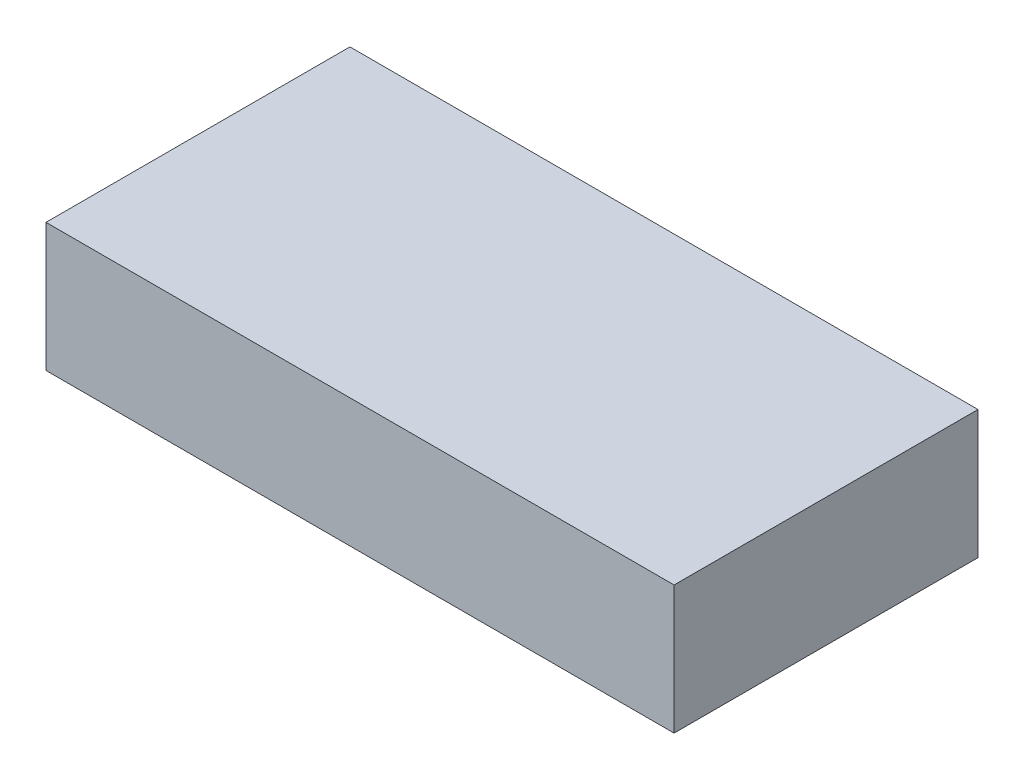
ISO-10303-21;
HEADER;
FILE_DESCRIPTION(('STEP AP214'),'2;1');
FILE_NAME('part.step','',(''),(''),'','','');
FILE_SCHEMA(('AUTOMOTIVE_DESIGN { 1 0 10303 214 1 1 1 1 }'));
ENDSEC;
DATA;
#1=APPLICATION_CONTEXT('core data for automotive mechanical design processes');
#2=APPLICATION_PROTOCOL_DEFINITION('international standard','automotive_design',2000,#1);
#3=PRODUCT_CONTEXT('',#1,'mechanical');
#4=PRODUCT('Part','Part','',(#3));
#5=PRODUCT_RELATED_PRODUCT_CATEGORY('part','',(#4));
#6=PRODUCT_DEFINITION_FORMATION('','',#4);
#7=PRODUCT_DEFINITION_CONTEXT('part definition',#1,'design');
#8=PRODUCT_DEFINITION('design','',#6,#7);
#9=PRODUCT_DEFINITION_SHAPE('','',#8);
#10=(LENGTH_UNIT() NAMED_UNIT(*) SI_UNIT(.MILLI.,.METRE.));
#11=(NAMED_UNIT(*) PLANE_ANGLE_UNIT() SI_UNIT($,.RADIAN.));
#12=(NAMED_UNIT(*) SI_UNIT($,.STERADIAN.) SOLID_ANGLE_UNIT());
#13=UNCERTAINTY_MEASURE_WITH_UNIT(LENGTH_MEASURE(1.E-05),#10,'distance_accuracy_value','');
#14=(GEOMETRIC_REPRESENTATION_CONTEXT(3) GLOBAL_UNCERTAINTY_ASSIGNED_CONTEXT((#13)) GLOBAL_UNIT_ASSIGNED_CONTEXT((#10,
#11,#12)) REPRESENTATION_CONTEXT('',''));
#15=CARTESIAN_POINT('',(0.,0.,0.));
#16=DIRECTION('',(0.,0.,1.));
#17=DIRECTION('',(1.,0.,0.));
#18=AXIS2_PLACEMENT_3D('',#15,#16,#17);
#19=CARTESIAN_POINT('',(-23.1049285714286,14.478,-12.7056696428571));
#20=DIRECTION('',(1.,0.,0.));
#21=DIRECTION('',(0.,0.,-1.));
#22=AXIS2_PLACEMENT_3D('',#19,#20,#21);
#23=PLANE('',#22);
#24=DIRECTION('',(0.,0.,1.));
#25=VECTOR('',#24,1.);
#26=CARTESIAN_POINT('',(-23.1049285714286,0.,-12.7056696428571));
#27=LINE('',#26,#25);
#28=CARTESIAN_POINT('',(-23.1049285714286,0.,-12.7056696428571));
#29=VERTEX_POINT('',#28);
#30=CARTESIAN_POINT('',(-23.1049285714286,0.,21.5843303571429));
#31=VERTEX_POINT('',#30);
#32=EDGE_CURVE('E100',#29,#31,#27,.T.);
#33=ORIENTED_EDGE('',*,*,#32,.T.);
#34=DIRECTION('',(0.,-1.,0.));
#35=VECTOR('',#34,1.);
#36=CARTESIAN_POINT('',(-23.1049285714286,14.478,21.5843303571429));
#37=LINE('',#36,#35);
#38=CARTESIAN_POINT('',(-23.1049285714286,14.478,21.5843303571429));
#39=VERTEX_POINT('',#38);
#40=EDGE_CURVE('E11',#39,#31,#37,.T.);
#41=ORIENTED_EDGE('',*,*,#40,.F.);
#42=DIRECTION('',(0.,0.,1.));
#43=VECTOR('',#42,1.);
#44=CARTESIAN_POINT('',(-23.1049285714286,14.478,-12.7056696428571));
#45=LINE('',#44,#43);
#46=CARTESIAN_POINT('',(-23.1049285714286,14.478,-12.7056696428571));
#47=VERTEX_POINT('',#46);
#48=EDGE_CURVE('E88',#47,#39,#45,.T.);
#49=ORIENTED_EDGE('',*,*,#48,.F.);
#50=DIRECTION('',(0.,-1.,0.));
#51=VECTOR('',#50,1.);
#52=CARTESIAN_POINT('',(-23.1049285714286,14.478,-12.7056696428571));
#53=LINE('',#52,#51);
#54=EDGE_CURVE('E96',#47,#29,#53,.T.);
#55=ORIENTED_EDGE('',*,*,#54,.T.);
#56=EDGE_LOOP('',(#33,#41,#49,#55));
#57=FACE_BOUND('',#56,.T.);
#58=ADVANCED_FACE('F37',(#57),#23,.F.);
#59=CARTESIAN_POINT('',(-23.1049285714286,14.478,21.5843303571429));
#60=DIRECTION('',(0.,0.,-1.));
#61=DIRECTION('',(-1.,0.,0.));
#62=AXIS2_PLACEMENT_3D('',#59,#60,#61);
#63=PLANE('',#62);
#64=DIRECTION('',(1.,0.,0.));
#65=VECTOR('',#64,1.);
#66=CARTESIAN_POINT('',(-23.1049285714286,0.,21.5843303571429));
#67=LINE('',#66,#65);
#68=CARTESIAN_POINT('',(47.7610714285714,0.,21.5843303571429));
#69=VERTEX_POINT('',#68);
#70=EDGE_CURVE('E92',#31,#69,#67,.T.);
#71=ORIENTED_EDGE('',*,*,#70,.T.);
#72=DIRECTION('',(0.,-1.,0.));
#73=VECTOR('',#72,1.);
#74=CARTESIAN_POINT('',(47.7610714285714,14.478,21.5843303571429));
#75=LINE('',#74,#73);
#76=CARTESIAN_POINT('',(47.7610714285714,14.478,21.5843303571429));
#77=VERTEX_POINT('',#76);
#78=EDGE_CURVE('E45',#77,#69,#75,.T.);
#79=ORIENTED_EDGE('',*,*,#78,.F.);
#80=DIRECTION('',(1.,0.,0.));
#81=VECTOR('',#80,1.);
#82=CARTESIAN_POINT('',(-23.1049285714286,14.478,21.5843303571429));
#83=LINE('',#82,#81);
#84=EDGE_CURVE('E83',#39,#77,#83,.T.);
#85=ORIENTED_EDGE('',*,*,#84,.F.);
#86=ORIENTED_EDGE('',*,*,#40,.T.);
#87=EDGE_LOOP('',(#71,#79,#85,#86));
#88=FACE_BOUND('',#87,.T.);
#89=ADVANCED_FACE('F91',(#88),#63,.F.);
#90=CARTESIAN_POINT('',(47.7610714285714,14.478,-12.7056696428571));
#91=DIRECTION('',(-1.,0.,0.));
#92=DIRECTION('',(0.,0.,1.));
#93=AXIS2_PLACEMENT_3D('',#90,#91,#92);
#94=PLANE('',#93);
#95=DIRECTION('',(0.,0.,-1.));
#96=VECTOR('',#95,1.);
#97=CARTESIAN_POINT('',(47.7610714285714,0.,-12.7056696428571));
#98=LINE('',#97,#96);
#99=CARTESIAN_POINT('',(47.7610714285714,0.,-12.7056696428571));
#100=VERTEX_POINT('',#99);
#101=EDGE_CURVE('E70',#69,#100,#98,.T.);
#102=ORIENTED_EDGE('',*,*,#101,.T.);
#103=DIRECTION('',(0.,-1.,0.));
#104=VECTOR('',#103,1.);
#105=CARTESIAN_POINT('',(47.7610714285714,14.478,-12.7056696428571));
#106=LINE('',#105,#104);
#107=CARTESIAN_POINT('',(47.7610714285714,14.478,-12.7056696428571));
#108=VERTEX_POINT('',#107);
#109=EDGE_CURVE('E93',#108,#100,#106,.T.);
#110=ORIENTED_EDGE('',*,*,#109,.F.);
#111=DIRECTION('',(0.,0.,-1.));
#112=VECTOR('',#111,1.);
#113=CARTESIAN_POINT('',(47.7610714285714,14.478,-12.7056696428571));
#114=LINE('',#113,#112);
#115=EDGE_CURVE('E86',#77,#108,#114,.T.);
#116=ORIENTED_EDGE('',*,*,#115,.F.);
#117=ORIENTED_EDGE('',*,*,#78,.T.);
#118=EDGE_LOOP('',(#102,#110,#116,#117));
#119=FACE_BOUND('',#118,.T.);
#120=ADVANCED_FACE('F94',(#119),#94,.F.);
#121=CARTESIAN_POINT('',(-23.1049285714286,14.478,-12.7056696428571));
#122=DIRECTION('',(0.,0.,1.));
#123=DIRECTION('',(1.,0.,0.));
#124=AXIS2_PLACEMENT_3D('',#121,#122,#123);
#125=PLANE('',#124);
#126=DIRECTION('',(-1.,0.,0.));
#127=VECTOR('',#126,1.);
#128=CARTESIAN_POINT('',(-23.1049285714286,0.,-12.7056696428571));
#129=LINE('',#128,#127);
#130=EDGE_CURVE('E76',#100,#29,#129,.T.);
#131=ORIENTED_EDGE('',*,*,#130,.T.);
#132=ORIENTED_EDGE('',*,*,#54,.F.);
#133=DIRECTION('',(-1.,0.,0.));
#134=VECTOR('',#133,1.);
#135=CARTESIAN_POINT('',(-23.1049285714286,14.478,-12.7056696428571));
#136=LINE('',#135,#134);
#137=EDGE_CURVE('E53',#108,#47,#136,.T.);
#138=ORIENTED_EDGE('',*,*,#137,.F.);
#139=ORIENTED_EDGE('',*,*,#109,.T.);
#140=EDGE_LOOP('',(#131,#132,#138,#139));
#141=FACE_BOUND('',#140,.T.);
#142=ADVANCED_FACE('F107',(#141),#125,.F.);
#143=CARTESIAN_POINT('',(0.,14.478,0.));
#144=DIRECTION('',(0.,1.,0.));
#145=DIRECTION('',(0.,0.,1.));
#146=AXIS2_PLACEMENT_3D('',#143,#144,#145);
#147=PLANE('',#146);
#148=ORIENTED_EDGE('',*,*,#48,.T.);
#149=ORIENTED_EDGE('',*,*,#84,.T.);
#150=ORIENTED_EDGE('',*,*,#115,.T.);
#151=ORIENTED_EDGE('',*,*,#137,.T.);
#152=EDGE_LOOP('',(#148,#149,#150,#151));
#153=FACE_BOUND('',#152,.T.);
#154=ADVANCED_FACE('F84',(#153),#147,.T.);
#155=CARTESIAN_POINT('',(0.,0.,0.));
#156=DIRECTION('',(0.,1.,0.));
#157=DIRECTION('',(0.,0.,1.));
#158=AXIS2_PLACEMENT_3D('',#155,#156,#157);
#159=PLANE('',#158);
#160=ORIENTED_EDGE('',*,*,#32,.F.);
#161=ORIENTED_EDGE('',*,*,#130,.F.);
#162=ORIENTED_EDGE('',*,*,#101,.F.);
#163=ORIENTED_EDGE('',*,*,#70,.F.);
#164=EDGE_LOOP('',(#160,#161,#162,#163));
#165=FACE_BOUND('',#164,.T.);
#166=ADVANCED_FACE('F110',(#165),#159,.F.);
#167=CLOSED_SHELL('',(#58,#89,#120,#142,#154,#166));
#168=MANIFOLD_SOLID_BREP('B2',#167);
#169=ADVANCED_BREP_SHAPE_REPRESENTATION('',(#18,#168),#14);
#170=SHAPE_DEFINITION_REPRESENTATION(#9,#169);
ENDSEC;
END-ISO-10303-21;
